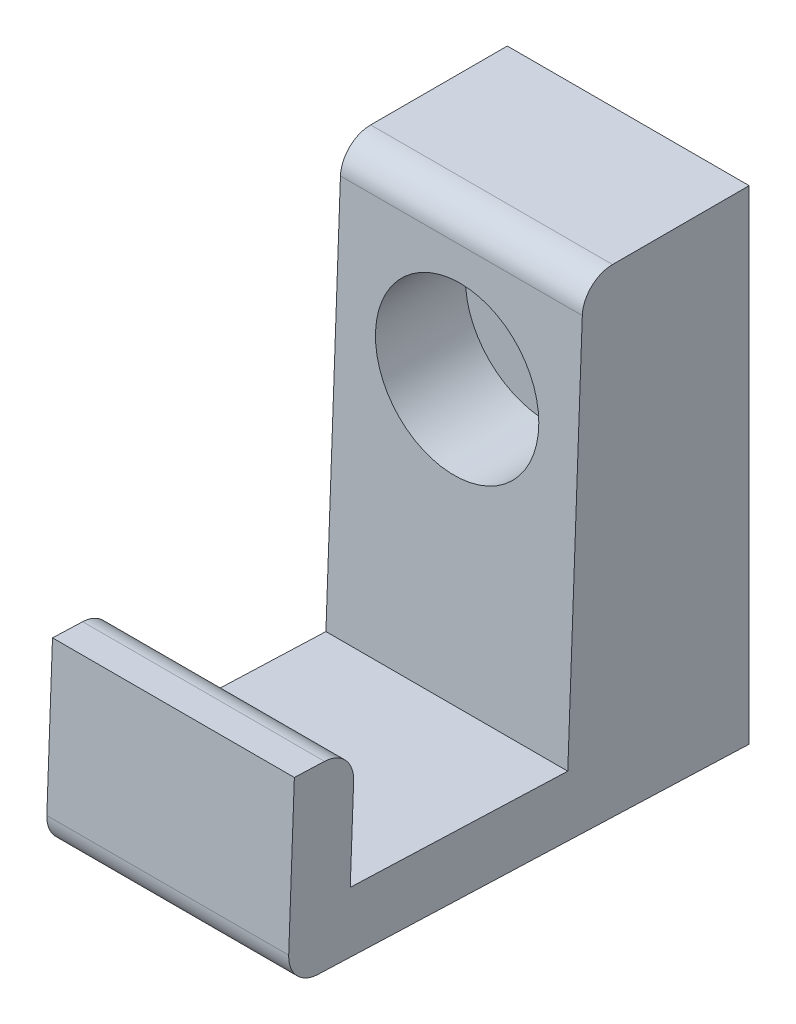
ISO-10303-21;
HEADER;
FILE_DESCRIPTION(('STEP AP214'),'2;1');
FILE_NAME('part.step','',(''),(''),'','','');
FILE_SCHEMA(('AUTOMOTIVE_DESIGN { 1 0 10303 214 1 1 1 1 }'));
ENDSEC;
DATA;
#1=APPLICATION_CONTEXT('core data for automotive mechanical design processes');
#2=APPLICATION_PROTOCOL_DEFINITION('international standard','automotive_design',2000,#1);
#3=PRODUCT_CONTEXT('',#1,'mechanical');
#4=PRODUCT('Part','Part','',(#3));
#5=PRODUCT_RELATED_PRODUCT_CATEGORY('part','',(#4));
#6=PRODUCT_DEFINITION_FORMATION('','',#4);
#7=PRODUCT_DEFINITION_CONTEXT('part definition',#1,'design');
#8=PRODUCT_DEFINITION('design','',#6,#7);
#9=PRODUCT_DEFINITION_SHAPE('','',#8);
#10=(LENGTH_UNIT() NAMED_UNIT(*) SI_UNIT(.MILLI.,.METRE.));
#11=(NAMED_UNIT(*) PLANE_ANGLE_UNIT() SI_UNIT($,.RADIAN.));
#12=(NAMED_UNIT(*) SI_UNIT($,.STERADIAN.) SOLID_ANGLE_UNIT());
#13=UNCERTAINTY_MEASURE_WITH_UNIT(LENGTH_MEASURE(1.E-05),#10,'distance_accuracy_value','');
#14=(GEOMETRIC_REPRESENTATION_CONTEXT(3) GLOBAL_UNCERTAINTY_ASSIGNED_CONTEXT((#13)) GLOBAL_UNIT_ASSIGNED_CONTEXT((#10,
#11,#12)) REPRESENTATION_CONTEXT('',''));
#15=CARTESIAN_POINT('',(0.,0.,0.));
#16=DIRECTION('',(0.,0.,1.));
#17=DIRECTION('',(1.,0.,0.));
#18=AXIS2_PLACEMENT_3D('',#15,#16,#17);
#19=CARTESIAN_POINT('',(10.,1.43225211327246,38.1713030460591));
#20=DIRECTION('',(0.,0.999296803505642,-0.0374953130858638));
#21=DIRECTION('',(0.,0.0374953130858638,0.999296803505642));
#22=AXIS2_PLACEMENT_3D('',#19,#20,#21);
#23=PLANE('',#22);
#24=DIRECTION('',(0.,-0.0374953130858638,-0.999296803505642));
#25=VECTOR('',#24,1.);
#26=CARTESIAN_POINT('',(10.,1.43225211327246,38.1713030460591));
#27=LINE('',#26,#25);
#28=CARTESIAN_POINT('',(10.,1.3385138305578,35.673061037295));
#29=VERTEX_POINT('',#28);
#30=CARTESIAN_POINT('',(10.,0.,0.));
#31=VERTEX_POINT('',#30);
#32=EDGE_CURVE('E114',#29,#31,#27,.T.);
#33=ORIENTED_EDGE('',*,*,#32,.F.);
#34=DIRECTION('',(-1.,0.,0.));
#35=VECTOR('',#34,1.);
#36=CARTESIAN_POINT('',(10.,1.3385138305578,35.673061037295));
#37=LINE('',#36,#35);
#38=CARTESIAN_POINT('',(-10.,1.3385138305578,35.673061037295));
#39=VERTEX_POINT('',#38);
#40=EDGE_CURVE('E141',#29,#39,#37,.T.);
#41=ORIENTED_EDGE('',*,*,#40,.T.);
#42=DIRECTION('',(0.,-0.0374953130858638,-0.999296803505642));
#43=VECTOR('',#42,1.);
#44=CARTESIAN_POINT('',(-10.,1.43225211327246,38.1713030460591));
#45=LINE('',#44,#43);
#46=CARTESIAN_POINT('',(-10.,0.,0.));
#47=VERTEX_POINT('',#46);
#48=EDGE_CURVE('E139',#39,#47,#45,.T.);
#49=ORIENTED_EDGE('',*,*,#48,.T.);
#50=DIRECTION('',(-1.,0.,0.));
#51=VECTOR('',#50,1.);
#52=CARTESIAN_POINT('',(10.,0.,0.));
#53=LINE('',#52,#51);
#54=EDGE_CURVE('E132',#31,#47,#53,.T.);
#55=ORIENTED_EDGE('',*,*,#54,.F.);
#56=EDGE_LOOP('',(#33,#41,#49,#55));
#57=FACE_BOUND('',#56,.T.);
#58=ADVANCED_FACE('F33',(#57),#23,.F.);
#59=CARTESIAN_POINT('',(10.,0.,0.));
#60=DIRECTION('',(0.,0.,1.));
#61=DIRECTION('',(1.,0.,0.));
#62=AXIS2_PLACEMENT_3D('',#59,#60,#61);
#63=PLANE('',#62);
#64=CARTESIAN_POINT('',(0.,28.2108520829285,0.));
#65=DIRECTION('',(0.,0.,1.));
#66=DIRECTION('',(1.,0.,0.));
#67=AXIS2_PLACEMENT_3D('',#64,#65,#66);
#68=CIRCLE('',#67,2.5);
#69=CARTESIAN_POINT('',(2.5,28.2108520829285,0.));
#70=VERTEX_POINT('',#69);
#71=EDGE_CURVE('E225',#70,#70,#68,.F.);
#72=ORIENTED_EDGE('',*,*,#71,.F.);
#73=EDGE_LOOP('',(#72));
#74=FACE_BOUND('',#73,.T.);
#75=DIRECTION('',(0.,1.,0.));
#76=VECTOR('',#75,1.);
#77=CARTESIAN_POINT('',(-10.,0.,0.));
#78=LINE('',#77,#76);
#79=CARTESIAN_POINT('',(-10.,40.,0.));
#80=VERTEX_POINT('',#79);
#81=EDGE_CURVE('E208',#47,#80,#78,.T.);
#82=ORIENTED_EDGE('',*,*,#81,.T.);
#83=DIRECTION('',(-1.,0.,0.));
#84=VECTOR('',#83,1.);
#85=CARTESIAN_POINT('',(10.,40.,0.));
#86=LINE('',#85,#84);
#87=CARTESIAN_POINT('',(10.,40.,0.));
#88=VERTEX_POINT('',#87);
#89=EDGE_CURVE('E134',#88,#80,#86,.T.);
#90=ORIENTED_EDGE('',*,*,#89,.F.);
#91=DIRECTION('',(0.,1.,0.));
#92=VECTOR('',#91,1.);
#93=CARTESIAN_POINT('',(10.,0.,0.));
#94=LINE('',#93,#92);
#95=EDGE_CURVE('E119',#31,#88,#94,.T.);
#96=ORIENTED_EDGE('',*,*,#95,.F.);
#97=ORIENTED_EDGE('',*,*,#54,.T.);
#98=EDGE_LOOP('',(#82,#90,#96,#97));
#99=FACE_BOUND('',#98,.T.);
#100=ADVANCED_FACE('F131',(#74,#99),#63,.F.);
#101=CARTESIAN_POINT('',(10.,40.,0.));
#102=DIRECTION('',(0.,-1.,0.));
#103=DIRECTION('',(0.,0.,-1.));
#104=AXIS2_PLACEMENT_3D('',#101,#102,#103);
#105=PLANE('',#104);
#106=DIRECTION('',(0.,0.,1.));
#107=VECTOR('',#106,1.);
#108=CARTESIAN_POINT('',(-10.,40.,0.));
#109=LINE('',#108,#107);
#110=CARTESIAN_POINT('',(-10.,40.,11.3000357657938));
#111=VERTEX_POINT('',#110);
#112=EDGE_CURVE('E203',#80,#111,#109,.T.);
#113=ORIENTED_EDGE('',*,*,#112,.T.);
#114=DIRECTION('',(-1.,0.,0.));
#115=VECTOR('',#114,1.);
#116=CARTESIAN_POINT('',(10.,40.,11.3000357657938));
#117=LINE('',#116,#115);
#118=CARTESIAN_POINT('',(10.,40.,11.3000357657938));
#119=VERTEX_POINT('',#118);
#120=EDGE_CURVE('E163',#111,#119,#117,.F.);
#121=ORIENTED_EDGE('',*,*,#120,.T.);
#122=DIRECTION('',(0.,0.,1.));
#123=VECTOR('',#122,1.);
#124=CARTESIAN_POINT('',(10.,40.,0.));
#125=LINE('',#124,#123);
#126=EDGE_CURVE('E136',#88,#119,#125,.T.);
#127=ORIENTED_EDGE('',*,*,#126,.F.);
#128=ORIENTED_EDGE('',*,*,#89,.T.);
#129=EDGE_LOOP('',(#113,#121,#127,#128));
#130=FACE_BOUND('',#129,.T.);
#131=ADVANCED_FACE('F256',(#130),#105,.F.);
#132=CARTESIAN_POINT('',(10.,40.,13.7079907485816));
#133=DIRECTION('',(0.,-0.0374953130858642,-0.999296803505642));
#134=DIRECTION('',(0.,0.999296803505642,-0.0374953130858642));
#135=AXIS2_PLACEMENT_3D('',#132,#133,#134);
#136=PLANE('',#135);
#137=CARTESIAN_POINT('',(0.,28.2108520829285,14.1503395989086));
#138=DIRECTION('',(0.,-0.0374953130858642,-0.999296803505642));
#139=DIRECTION('',(0.,0.999296803505642,-0.0374953130858642));
#140=AXIS2_PLACEMENT_3D('',#137,#138,#139);
#141=ELLIPSE('',#140,6.75474991646152,6.75);
#142=CARTESIAN_POINT('',(0.,34.9608520829285,13.8970681359741));
#143=VERTEX_POINT('',#142);
#144=EDGE_CURVE('E211',#143,#143,#141,.T.);
#145=ORIENTED_EDGE('',*,*,#144,.T.);
#146=EDGE_LOOP('',(#145));
#147=FACE_BOUND('',#146,.T.);
#148=DIRECTION('',(0.,-0.999296803505642,0.0374953130858642));
#149=VECTOR('',#148,1.);
#150=CARTESIAN_POINT('',(10.,40.,13.7079907485816));
#151=LINE('',#150,#149);
#152=CARTESIAN_POINT('',(10.,37.5937382827147,13.7982777745579));
#153=VERTEX_POINT('',#152);
#154=CARTESIAN_POINT('',(10.,5.5663439298258,15.));
#155=VERTEX_POINT('',#154);
#156=EDGE_CURVE('E217',#153,#155,#151,.T.);
#157=ORIENTED_EDGE('',*,*,#156,.F.);
#158=DIRECTION('',(-1.,0.,0.));
#159=VECTOR('',#158,1.);
#160=CARTESIAN_POINT('',(10.,37.5937382827147,13.7982777745579));
#161=LINE('',#160,#159);
#162=CARTESIAN_POINT('',(-10.,37.5937382827147,13.7982777745579));
#163=VERTEX_POINT('',#162);
#164=EDGE_CURVE('E160',#153,#163,#161,.T.);
#165=ORIENTED_EDGE('',*,*,#164,.T.);
#166=DIRECTION('',(0.,-0.999296803505642,0.0374953130858642));
#167=VECTOR('',#166,1.);
#168=CARTESIAN_POINT('',(-10.,40.,13.7079907485816));
#169=LINE('',#168,#167);
#170=CARTESIAN_POINT('',(-10.,5.5663439298258,15.));
#171=VERTEX_POINT('',#170);
#172=EDGE_CURVE('E202',#163,#171,#169,.T.);
#173=ORIENTED_EDGE('',*,*,#172,.T.);
#174=DIRECTION('',(-1.,0.,0.));
#175=VECTOR('',#174,1.);
#176=CARTESIAN_POINT('',(10.,5.5663439298258,15.));
#177=LINE('',#176,#175);
#178=EDGE_CURVE('E145',#155,#171,#177,.T.);
#179=ORIENTED_EDGE('',*,*,#178,.F.);
#180=EDGE_LOOP('',(#157,#165,#173,#179));
#181=FACE_BOUND('',#180,.T.);
#182=ADVANCED_FACE('F273',(#147,#181),#136,.F.);
#183=CARTESIAN_POINT('',(10.,5.5663439298258,15.));
#184=DIRECTION('',(0.,-0.999296803505642,0.0374953130858639));
#185=DIRECTION('',(0.,-0.0374953130858639,-0.999296803505642));
#186=AXIS2_PLACEMENT_3D('',#183,#184,#185);
#187=PLANE('',#186);
#188=DIRECTION('',(0.,0.0374953130858639,0.999296803505642));
#189=VECTOR('',#188,1.);
#190=CARTESIAN_POINT('',(-10.,5.5663439298258,15.));
#191=LINE('',#190,#189);
#192=CARTESIAN_POINT('',(-10.,6.24125956537135,32.9873424631016));
#193=VERTEX_POINT('',#192);
#194=EDGE_CURVE('E182',#171,#193,#191,.T.);
#195=ORIENTED_EDGE('',*,*,#194,.T.);
#196=DIRECTION('',(-1.,0.,0.));
#197=VECTOR('',#196,1.);
#198=CARTESIAN_POINT('',(10.,6.24125956537135,32.9873424631016));
#199=LINE('',#198,#197);
#200=CARTESIAN_POINT('',(10.,6.24125956537135,32.9873424631016));
#201=VERTEX_POINT('',#200);
#202=EDGE_CURVE('E188',#201,#193,#199,.T.);
#203=ORIENTED_EDGE('',*,*,#202,.F.);
#204=DIRECTION('',(0.,0.0374953130858639,0.999296803505642));
#205=VECTOR('',#204,1.);
#206=CARTESIAN_POINT('',(10.,5.5663439298258,15.));
#207=LINE('',#206,#205);
#208=EDGE_CURVE('E198',#155,#201,#207,.T.);
#209=ORIENTED_EDGE('',*,*,#208,.F.);
#210=ORIENTED_EDGE('',*,*,#178,.T.);
#211=EDGE_LOOP('',(#195,#203,#209,#210));
#212=FACE_BOUND('',#211,.T.);
#213=ADVANCED_FACE('F196',(#212),#187,.F.);
#214=CARTESIAN_POINT('',(10.,6.24125956537135,32.9873424631016));
#215=DIRECTION('',(0.,0.0374953130858613,0.999296803505642));
#216=DIRECTION('',(0.,-0.999296803505642,0.0374953130858613));
#217=AXIS2_PLACEMENT_3D('',#214,#215,#216);
#218=PLANE('',#217);
#219=DIRECTION('',(0.,0.999296803505642,-0.0374953130858613));
#220=VECTOR('',#219,1.);
#221=CARTESIAN_POINT('',(-10.,6.24125956537135,32.9873424631016));
#222=LINE('',#221,#220);
#223=CARTESIAN_POINT('',(-10.,13.7359855916637,32.7061276149576));
#224=VERTEX_POINT('',#223);
#225=EDGE_CURVE('E179',#193,#224,#222,.T.);
#226=ORIENTED_EDGE('',*,*,#225,.T.);
#227=DIRECTION('',(-1.,0.,0.));
#228=VECTOR('',#227,1.);
#229=CARTESIAN_POINT('',(10.,13.7359855916637,32.7061276149576));
#230=LINE('',#229,#228);
#231=CARTESIAN_POINT('',(10.,13.7359855916637,32.7061276149576));
#232=VERTEX_POINT('',#231);
#233=EDGE_CURVE('E11',#224,#232,#230,.F.);
#234=ORIENTED_EDGE('',*,*,#233,.T.);
#235=DIRECTION('',(0.,0.999296803505642,-0.0374953130858613));
#236=VECTOR('',#235,1.);
#237=CARTESIAN_POINT('',(10.,6.24125956537135,32.9873424631016));
#238=LINE('',#237,#236);
#239=EDGE_CURVE('E214',#201,#232,#238,.T.);
#240=ORIENTED_EDGE('',*,*,#239,.F.);
#241=ORIENTED_EDGE('',*,*,#202,.T.);
#242=EDGE_LOOP('',(#226,#234,#240,#241));
#243=FACE_BOUND('',#242,.T.);
#244=ADVANCED_FACE('F281',(#243),#218,.F.);
#245=CARTESIAN_POINT('',(10.,16.2342276004278,32.6123893322429));
#246=DIRECTION('',(0.,-0.999296803505642,0.0374953130858635));
#247=DIRECTION('',(0.,-0.0374953130858635,-0.999296803505642));
#248=AXIS2_PLACEMENT_3D('',#245,#246,#247);
#249=PLANE('',#248);
#250=DIRECTION('',(0.,0.0374953130858635,0.999296803505642));
#251=VECTOR('',#250,1.);
#252=CARTESIAN_POINT('',(10.,16.2342276004278,32.6123893322429));
#253=LINE('',#252,#251);
#254=CARTESIAN_POINT('',(10.,16.3279658831424,35.110631341007));
#255=VERTEX_POINT('',#254);
#256=CARTESIAN_POINT('',(10.,16.4217041658571,37.6088733497711));
#257=VERTEX_POINT('',#256);
#258=EDGE_CURVE('E172',#255,#257,#253,.T.);
#259=ORIENTED_EDGE('',*,*,#258,.F.);
#260=DIRECTION('',(-1.,0.,0.));
#261=VECTOR('',#260,1.);
#262=CARTESIAN_POINT('',(10.,16.3279658831424,35.110631341007));
#263=LINE('',#262,#261);
#264=CARTESIAN_POINT('',(-10.,16.3279658831424,35.110631341007));
#265=VERTEX_POINT('',#264);
#266=EDGE_CURVE('E41',#255,#265,#263,.T.);
#267=ORIENTED_EDGE('',*,*,#266,.T.);
#268=DIRECTION('',(0.,0.0374953130858635,0.999296803505642));
#269=VECTOR('',#268,1.);
#270=CARTESIAN_POINT('',(-10.,16.2342276004278,32.6123893322429));
#271=LINE('',#270,#269);
#272=CARTESIAN_POINT('',(-10.,16.4217041658571,37.6088733497711));
#273=VERTEX_POINT('',#272);
#274=EDGE_CURVE('E170',#265,#273,#271,.T.);
#275=ORIENTED_EDGE('',*,*,#274,.T.);
#276=DIRECTION('',(-1.,0.,0.));
#277=VECTOR('',#276,1.);
#278=CARTESIAN_POINT('',(10.,16.4217041658571,37.6088733497711));
#279=LINE('',#278,#277);
#280=EDGE_CURVE('E186',#257,#273,#279,.T.);
#281=ORIENTED_EDGE('',*,*,#280,.F.);
#282=EDGE_LOOP('',(#259,#267,#275,#281));
#283=FACE_BOUND('',#282,.T.);
#284=ADVANCED_FACE('F168',(#283),#249,.F.);
#285=CARTESIAN_POINT('',(10.,16.4217041658571,37.6088733497711));
#286=DIRECTION('',(0.,-0.0374953130858631,-0.999296803505642));
#287=DIRECTION('',(0.,0.999296803505642,-0.0374953130858631));
#288=AXIS2_PLACEMENT_3D('',#285,#286,#287);
#289=PLANE('',#288);
#290=DIRECTION('',(0.,-0.999296803505642,0.0374953130858631));
#291=VECTOR('',#290,1.);
#292=CARTESIAN_POINT('',(-10.,16.4217041658571,37.6088733497711));
#293=LINE('',#292,#291);
#294=CARTESIAN_POINT('',(-10.,3.93049412203657,38.0775647633444));
#295=VERTEX_POINT('',#294);
#296=EDGE_CURVE('E127',#273,#295,#293,.T.);
#297=ORIENTED_EDGE('',*,*,#296,.T.);
#298=DIRECTION('',(-1.,0.,0.));
#299=VECTOR('',#298,1.);
#300=CARTESIAN_POINT('',(10.,3.93049412203657,38.0775647633444));
#301=LINE('',#300,#299);
#302=CARTESIAN_POINT('',(10.,3.93049412203657,38.0775647633444));
#303=VERTEX_POINT('',#302);
#304=EDGE_CURVE('E154',#295,#303,#301,.F.);
#305=ORIENTED_EDGE('',*,*,#304,.T.);
#306=DIRECTION('',(0.,-0.999296803505642,0.0374953130858631));
#307=VECTOR('',#306,1.);
#308=CARTESIAN_POINT('',(10.,16.4217041658571,37.6088733497711));
#309=LINE('',#308,#307);
#310=EDGE_CURVE('E189',#257,#303,#309,.T.);
#311=ORIENTED_EDGE('',*,*,#310,.F.);
#312=ORIENTED_EDGE('',*,*,#280,.T.);
#313=EDGE_LOOP('',(#297,#305,#311,#312));
#314=FACE_BOUND('',#313,.T.);
#315=ADVANCED_FACE('F289',(#314),#289,.F.);
#316=CARTESIAN_POINT('',(10.,0.,0.));
#317=DIRECTION('',(-1.,0.,0.));
#318=DIRECTION('',(0.,0.,1.));
#319=AXIS2_PLACEMENT_3D('',#316,#317,#318);
#320=PLANE('',#319);
#321=ORIENTED_EDGE('',*,*,#310,.T.);
#322=CARTESIAN_POINT('',(10.,3.83675583932191,35.5793227545803));
#323=DIRECTION('',(-1.,0.,0.));
#324=DIRECTION('',(0.,0.,1.));
#325=AXIS2_PLACEMENT_3D('',#322,#323,#324);
#326=CIRCLE('',#325,2.5);
#327=EDGE_CURVE('E122',#303,#29,#326,.F.);
#328=ORIENTED_EDGE('',*,*,#327,.T.);
#329=ORIENTED_EDGE('',*,*,#32,.T.);
#330=ORIENTED_EDGE('',*,*,#95,.T.);
#331=ORIENTED_EDGE('',*,*,#126,.T.);
#332=CARTESIAN_POINT('',(10.,37.5,11.3000357657938));
#333=DIRECTION('',(-1.,0.,0.));
#334=DIRECTION('',(0.,0.,1.));
#335=AXIS2_PLACEMENT_3D('',#332,#333,#334);
#336=CIRCLE('',#335,2.5);
#337=EDGE_CURVE('E157',#119,#153,#336,.F.);
#338=ORIENTED_EDGE('',*,*,#337,.T.);
#339=ORIENTED_EDGE('',*,*,#156,.T.);
#340=ORIENTED_EDGE('',*,*,#208,.T.);
#341=ORIENTED_EDGE('',*,*,#239,.T.);
#342=CARTESIAN_POINT('',(10.,13.8297238743783,35.2043696237217));
#343=DIRECTION('',(-1.,0.,0.));
#344=DIRECTION('',(0.,0.,1.));
#345=AXIS2_PLACEMENT_3D('',#342,#343,#344);
#346=CIRCLE('',#345,2.5);
#347=EDGE_CURVE('E48',#232,#255,#346,.F.);
#348=ORIENTED_EDGE('',*,*,#347,.T.);
#349=ORIENTED_EDGE('',*,*,#258,.T.);
#350=EDGE_LOOP('',(#321,#328,#329,#330,#331,#338,#339,#340,#341,#348,#349));
#351=FACE_BOUND('',#350,.T.);
#352=ADVANCED_FACE('F117',(#351),#320,.F.);
#353=CARTESIAN_POINT('',(-10.,0.,0.));
#354=DIRECTION('',(-1.,0.,0.));
#355=DIRECTION('',(0.,0.,1.));
#356=AXIS2_PLACEMENT_3D('',#353,#354,#355);
#357=PLANE('',#356);
#358=ORIENTED_EDGE('',*,*,#48,.F.);
#359=CARTESIAN_POINT('',(-10.,3.83675583932191,35.5793227545803));
#360=DIRECTION('',(-1.,0.,0.));
#361=DIRECTION('',(0.,0.,1.));
#362=AXIS2_PLACEMENT_3D('',#359,#360,#361);
#363=CIRCLE('',#362,2.5);
#364=EDGE_CURVE('E152',#39,#295,#363,.T.);
#365=ORIENTED_EDGE('',*,*,#364,.T.);
#366=ORIENTED_EDGE('',*,*,#296,.F.);
#367=ORIENTED_EDGE('',*,*,#274,.F.);
#368=CARTESIAN_POINT('',(-10.,13.8297238743783,35.2043696237217));
#369=DIRECTION('',(-1.,0.,0.));
#370=DIRECTION('',(0.,0.,1.));
#371=AXIS2_PLACEMENT_3D('',#368,#369,#370);
#372=CIRCLE('',#371,2.5);
#373=EDGE_CURVE('E143',#265,#224,#372,.T.);
#374=ORIENTED_EDGE('',*,*,#373,.T.);
#375=ORIENTED_EDGE('',*,*,#225,.F.);
#376=ORIENTED_EDGE('',*,*,#194,.F.);
#377=ORIENTED_EDGE('',*,*,#172,.F.);
#378=CARTESIAN_POINT('',(-10.,37.5,11.3000357657938));
#379=DIRECTION('',(-1.,0.,0.));
#380=DIRECTION('',(0.,0.,1.));
#381=AXIS2_PLACEMENT_3D('',#378,#379,#380);
#382=CIRCLE('',#381,2.5);
#383=EDGE_CURVE('E150',#163,#111,#382,.T.);
#384=ORIENTED_EDGE('',*,*,#383,.T.);
#385=ORIENTED_EDGE('',*,*,#112,.F.);
#386=ORIENTED_EDGE('',*,*,#81,.F.);
#387=EDGE_LOOP('',(#358,#365,#366,#367,#374,#375,#376,#377,#384,#385,#386));
#388=FACE_BOUND('',#387,.T.);
#389=ADVANCED_FACE('F176',(#388),#357,.T.);
#390=CARTESIAN_POINT('',(0.,28.2108520829285,38.1723030460591));
#391=DIRECTION('',(0.,0.,-1.));
#392=DIRECTION('',(-1.,0.,0.));
#393=AXIS2_PLACEMENT_3D('',#390,#391,#392);
#394=CYLINDRICAL_SURFACE('',#393,6.75);
#395=ORIENTED_EDGE('',*,*,#144,.F.);
#396=EDGE_LOOP('',(#395));
#397=FACE_BOUND('',#396,.T.);
#398=CARTESIAN_POINT('',(0.,28.2108520829285,6.70799074858158));
#399=DIRECTION('',(0.,0.,1.));
#400=DIRECTION('',(1.,0.,0.));
#401=AXIS2_PLACEMENT_3D('',#398,#399,#400);
#402=CIRCLE('',#401,6.75);
#403=CARTESIAN_POINT('',(6.75,28.2108520829285,6.70799074858158));
#404=VERTEX_POINT('',#403);
#405=EDGE_CURVE('E222',#404,#404,#402,.T.);
#406=ORIENTED_EDGE('',*,*,#405,.F.);
#407=EDGE_LOOP('',(#406));
#408=FACE_BOUND('',#407,.T.);
#409=ADVANCED_FACE('F238',(#397,#408),#394,.F.);
#410=CARTESIAN_POINT('',(0.,28.2108520829285,6.70799074858158));
#411=DIRECTION('',(0.,0.,1.));
#412=DIRECTION('',(1.,0.,0.));
#413=AXIS2_PLACEMENT_3D('',#410,#411,#412);
#414=PLANE('',#413);
#415=CARTESIAN_POINT('',(0.,28.2108520829285,6.70799074858158));
#416=DIRECTION('',(0.,0.,1.));
#417=DIRECTION('',(1.,0.,0.));
#418=AXIS2_PLACEMENT_3D('',#415,#416,#417);
#419=CIRCLE('',#418,2.5);
#420=CARTESIAN_POINT('',(2.5,28.2108520829285,6.70799074858158));
#421=VERTEX_POINT('',#420);
#422=EDGE_CURVE('E228',#421,#421,#419,.T.);
#423=ORIENTED_EDGE('',*,*,#422,.F.);
#424=EDGE_LOOP('',(#423));
#425=FACE_BOUND('',#424,.T.);
#426=ORIENTED_EDGE('',*,*,#405,.T.);
#427=EDGE_LOOP('',(#426));
#428=FACE_BOUND('',#427,.T.);
#429=ADVANCED_FACE('F235',(#425,#428),#414,.T.);
#430=CARTESIAN_POINT('',(0.,28.2108520829285,-0.00100000000000013));
#431=DIRECTION('',(0.,0.,1.));
#432=DIRECTION('',(1.,0.,0.));
#433=AXIS2_PLACEMENT_3D('',#430,#431,#432);
#434=CYLINDRICAL_SURFACE('',#433,2.5);
#435=ORIENTED_EDGE('',*,*,#422,.T.);
#436=EDGE_LOOP('',(#435));
#437=FACE_BOUND('',#436,.T.);
#438=ORIENTED_EDGE('',*,*,#71,.T.);
#439=EDGE_LOOP('',(#438));
#440=FACE_BOUND('',#439,.T.);
#441=ADVANCED_FACE('F232',(#437,#440),#434,.F.);
#442=CARTESIAN_POINT('',(10.,3.83675583932191,35.5793227545803));
#443=DIRECTION('',(-1.,0.,0.));
#444=DIRECTION('',(0.,0.,1.));
#445=AXIS2_PLACEMENT_3D('',#442,#443,#444);
#446=CYLINDRICAL_SURFACE('',#445,2.5);
#447=ORIENTED_EDGE('',*,*,#327,.F.);
#448=ORIENTED_EDGE('',*,*,#304,.F.);
#449=ORIENTED_EDGE('',*,*,#364,.F.);
#450=ORIENTED_EDGE('',*,*,#40,.F.);
#451=EDGE_LOOP('',(#447,#448,#449,#450));
#452=FACE_BOUND('',#451,.T.);
#453=ADVANCED_FACE('F261',(#452),#446,.T.);
#454=CARTESIAN_POINT('',(10.,37.5,11.3000357657938));
#455=DIRECTION('',(-1.,0.,0.));
#456=DIRECTION('',(0.,0.,1.));
#457=AXIS2_PLACEMENT_3D('',#454,#455,#456);
#458=CYLINDRICAL_SURFACE('',#457,2.5);
#459=ORIENTED_EDGE('',*,*,#337,.F.);
#460=ORIENTED_EDGE('',*,*,#120,.F.);
#461=ORIENTED_EDGE('',*,*,#383,.F.);
#462=ORIENTED_EDGE('',*,*,#164,.F.);
#463=EDGE_LOOP('',(#459,#460,#461,#462));
#464=FACE_BOUND('',#463,.T.);
#465=ADVANCED_FACE('F263',(#464),#458,.T.);
#466=CARTESIAN_POINT('',(10.,13.8297238743783,35.2043696237217));
#467=DIRECTION('',(-1.,0.,0.));
#468=DIRECTION('',(0.,0.,1.));
#469=AXIS2_PLACEMENT_3D('',#466,#467,#468);
#470=CYLINDRICAL_SURFACE('',#469,2.5);
#471=ORIENTED_EDGE('',*,*,#347,.F.);
#472=ORIENTED_EDGE('',*,*,#233,.F.);
#473=ORIENTED_EDGE('',*,*,#373,.F.);
#474=ORIENTED_EDGE('',*,*,#266,.F.);
#475=EDGE_LOOP('',(#471,#472,#473,#474));
#476=FACE_BOUND('',#475,.T.);
#477=ADVANCED_FACE('F35',(#476),#470,.T.);
#478=CLOSED_SHELL('',(#58,#100,#131,#182,#213,#244,#284,#315,#352,#389,#409,#429,#441,#453,#465,#477));
#479=MANIFOLD_SOLID_BREP('B2',#478);
#480=ADVANCED_BREP_SHAPE_REPRESENTATION('',(#18,#479),#14);
#481=SHAPE_DEFINITION_REPRESENTATION(#9,#480);
ENDSEC;
END-ISO-10303-21;
